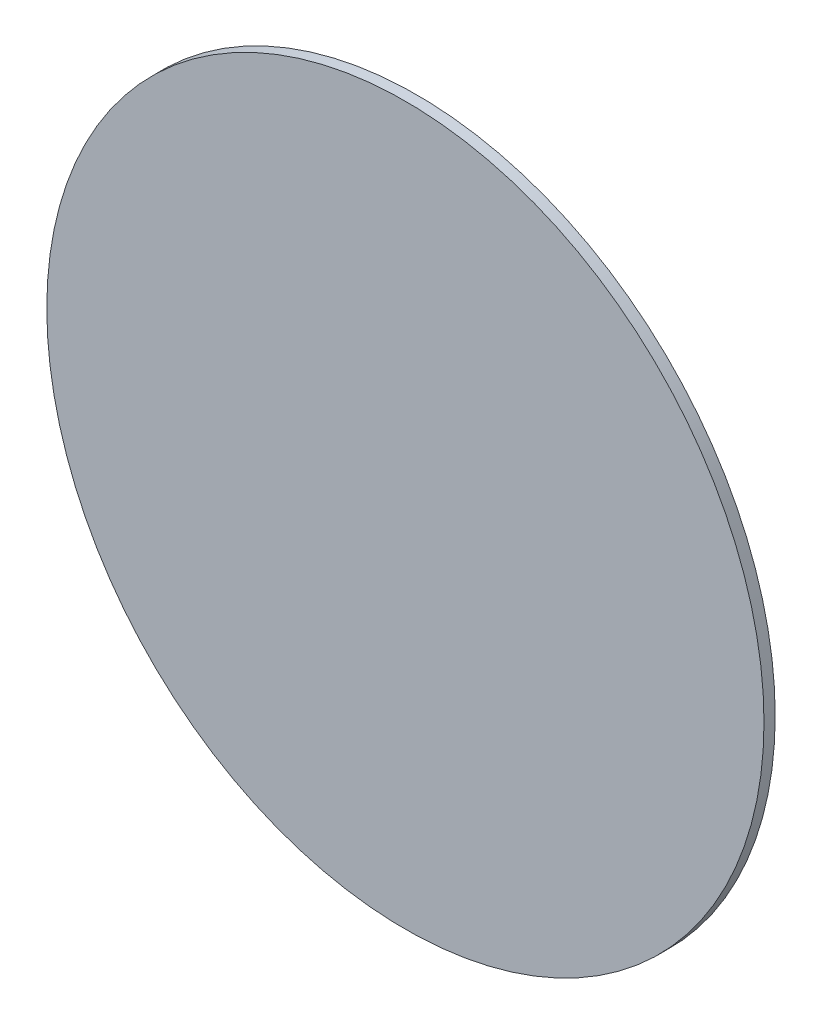
ISO-10303-21;
HEADER;
FILE_DESCRIPTION(('STEP AP214'),'2;1');
FILE_NAME('part.step','',(''),(''),'','','');
FILE_SCHEMA(('AUTOMOTIVE_DESIGN { 1 0 10303 214 1 1 1 1 }'));
ENDSEC;
DATA;
#1=APPLICATION_CONTEXT('core data for automotive mechanical design processes');
#2=APPLICATION_PROTOCOL_DEFINITION('international standard','automotive_design',2000,#1);
#3=PRODUCT_CONTEXT('',#1,'mechanical');
#4=PRODUCT('Part','Part','',(#3));
#5=PRODUCT_RELATED_PRODUCT_CATEGORY('part','',(#4));
#6=PRODUCT_DEFINITION_FORMATION('','',#4);
#7=PRODUCT_DEFINITION_CONTEXT('part definition',#1,'design');
#8=PRODUCT_DEFINITION('design','',#6,#7);
#9=PRODUCT_DEFINITION_SHAPE('','',#8);
#10=(LENGTH_UNIT() NAMED_UNIT(*) SI_UNIT(.MILLI.,.METRE.));
#11=(NAMED_UNIT(*) PLANE_ANGLE_UNIT() SI_UNIT($,.RADIAN.));
#12=(NAMED_UNIT(*) SI_UNIT($,.STERADIAN.) SOLID_ANGLE_UNIT());
#13=UNCERTAINTY_MEASURE_WITH_UNIT(LENGTH_MEASURE(1.E-05),#10,'distance_accuracy_value','');
#14=(GEOMETRIC_REPRESENTATION_CONTEXT(3) GLOBAL_UNCERTAINTY_ASSIGNED_CONTEXT((#13)) GLOBAL_UNIT_ASSIGNED_CONTEXT((#10,
#11,#12)) REPRESENTATION_CONTEXT('',''));
#15=CARTESIAN_POINT('',(0.,0.,0.));
#16=DIRECTION('',(0.,0.,1.));
#17=DIRECTION('',(1.,0.,0.));
#18=AXIS2_PLACEMENT_3D('',#15,#16,#17);
#19=CARTESIAN_POINT('',(0.,-145.575836249634,3.175));
#20=DIRECTION('',(0.,0.,-1.));
#21=DIRECTION('',(-1.,0.,0.));
#22=AXIS2_PLACEMENT_3D('',#19,#20,#21);
#23=CYLINDRICAL_SURFACE('',#22,101.6);
#24=CARTESIAN_POINT('',(0.,-145.575836249634,3.175));
#25=DIRECTION('',(0.,0.,1.));
#26=DIRECTION('',(1.,0.,0.));
#27=AXIS2_PLACEMENT_3D('',#24,#25,#26);
#28=CIRCLE('',#27,101.6);
#29=CARTESIAN_POINT('',(101.6,-145.575836249634,3.175));
#30=VERTEX_POINT('',#29);
#31=EDGE_CURVE('E10',#30,#30,#28,.T.);
#32=ORIENTED_EDGE('',*,*,#31,.F.);
#33=EDGE_LOOP('',(#32));
#34=FACE_BOUND('',#33,.T.);
#35=CARTESIAN_POINT('',(0.,-145.575836249634,0.));
#36=DIRECTION('',(0.,0.,1.));
#37=DIRECTION('',(1.,0.,0.));
#38=AXIS2_PLACEMENT_3D('',#35,#36,#37);
#39=CIRCLE('',#38,101.6);
#40=CARTESIAN_POINT('',(101.6,-145.575836249634,0.));
#41=VERTEX_POINT('',#40);
#42=EDGE_CURVE('E40',#41,#41,#39,.T.);
#43=ORIENTED_EDGE('',*,*,#42,.T.);
#44=EDGE_LOOP('',(#43));
#45=FACE_BOUND('',#44,.T.);
#46=ADVANCED_FACE('F37',(#34,#45),#23,.T.);
#47=CARTESIAN_POINT('',(0.,-145.575836249634,3.175));
#48=DIRECTION('',(0.,0.,1.));
#49=DIRECTION('',(1.,0.,0.));
#50=AXIS2_PLACEMENT_3D('',#47,#48,#49);
#51=PLANE('',#50);
#52=ORIENTED_EDGE('',*,*,#31,.T.);
#53=EDGE_LOOP('',(#52));
#54=FACE_BOUND('',#53,.T.);
#55=ADVANCED_FACE('F52',(#54),#51,.T.);
#56=CARTESIAN_POINT('',(0.,-145.575836249634,0.));
#57=DIRECTION('',(0.,0.,1.));
#58=DIRECTION('',(1.,0.,0.));
#59=AXIS2_PLACEMENT_3D('',#56,#57,#58);
#60=PLANE('',#59);
#61=ORIENTED_EDGE('',*,*,#42,.F.);
#62=EDGE_LOOP('',(#61));
#63=FACE_BOUND('',#62,.T.);
#64=ADVANCED_FACE('F50',(#63),#60,.F.);
#65=CLOSED_SHELL('',(#46,#55,#64));
#66=MANIFOLD_SOLID_BREP('B2',#65);
#67=ADVANCED_BREP_SHAPE_REPRESENTATION('',(#18,#66),#14);
#68=SHAPE_DEFINITION_REPRESENTATION(#9,#67);
ENDSEC;
END-ISO-10303-21;
